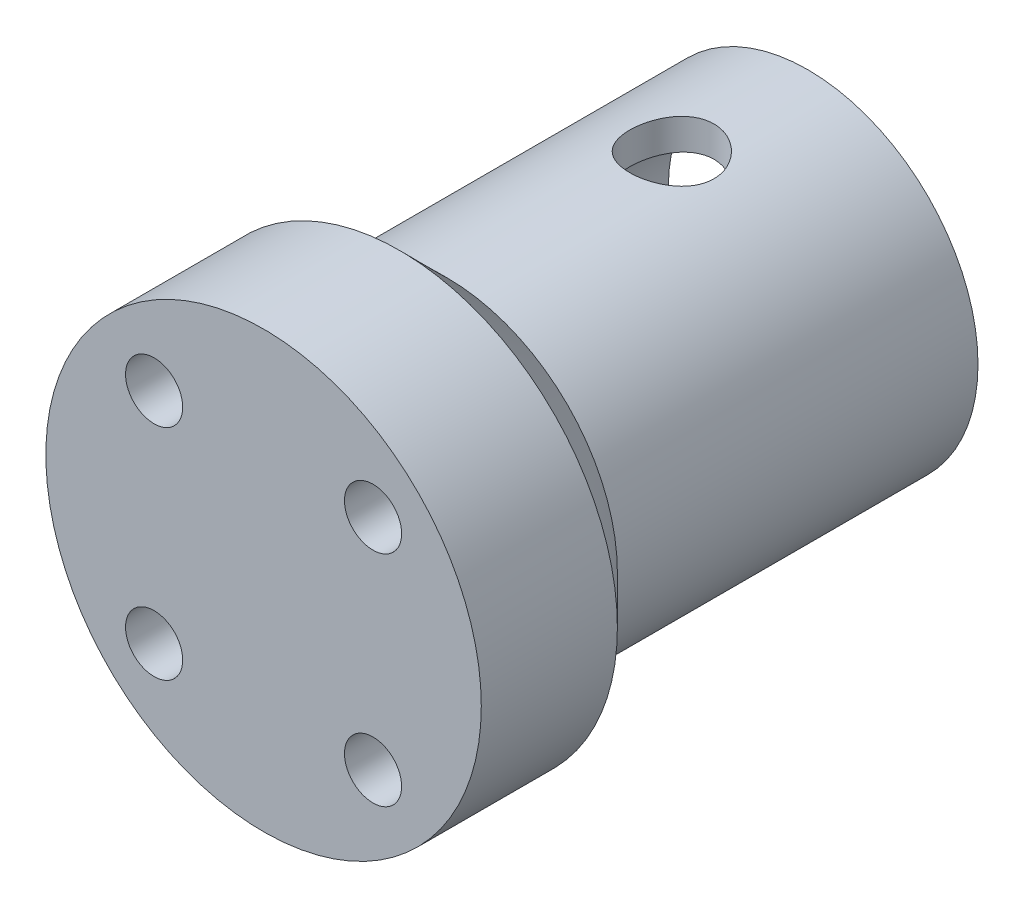
ISO-10303-21;
HEADER;
FILE_DESCRIPTION(('STEP AP214'),'2;1');
FILE_NAME('part.step','',(''),(''),'','','');
FILE_SCHEMA(('AUTOMOTIVE_DESIGN { 1 0 10303 214 1 1 1 1 }'));
ENDSEC;
DATA;
#1=APPLICATION_CONTEXT('core data for automotive mechanical design processes');
#2=APPLICATION_PROTOCOL_DEFINITION('international standard','automotive_design',2000,#1);
#3=PRODUCT_CONTEXT('',#1,'mechanical');
#4=PRODUCT('Part','Part','',(#3));
#5=PRODUCT_RELATED_PRODUCT_CATEGORY('part','',(#4));
#6=PRODUCT_DEFINITION_FORMATION('','',#4);
#7=PRODUCT_DEFINITION_CONTEXT('part definition',#1,'design');
#8=PRODUCT_DEFINITION('design','',#6,#7);
#9=PRODUCT_DEFINITION_SHAPE('','',#8);
#10=(LENGTH_UNIT() NAMED_UNIT(*) SI_UNIT(.MILLI.,.METRE.));
#11=(NAMED_UNIT(*) PLANE_ANGLE_UNIT() SI_UNIT($,.RADIAN.));
#12=(NAMED_UNIT(*) SI_UNIT($,.STERADIAN.) SOLID_ANGLE_UNIT());
#13=UNCERTAINTY_MEASURE_WITH_UNIT(LENGTH_MEASURE(1.E-05),#10,'distance_accuracy_value','');
#14=(GEOMETRIC_REPRESENTATION_CONTEXT(3) GLOBAL_UNCERTAINTY_ASSIGNED_CONTEXT((#13)) GLOBAL_UNIT_ASSIGNED_CONTEXT((#10,
#11,#12)) REPRESENTATION_CONTEXT('',''));
#15=CARTESIAN_POINT('',(0.,0.,0.));
#16=DIRECTION('',(0.,0.,1.));
#17=DIRECTION('',(1.,0.,0.));
#18=AXIS2_PLACEMENT_3D('',#15,#16,#17);
#19=CARTESIAN_POINT('',(0.,0.,10.));
#20=DIRECTION('',(0.,0.,-1.));
#21=DIRECTION('',(-1.,0.,0.));
#22=AXIS2_PLACEMENT_3D('',#19,#20,#21);
#23=CYLINDRICAL_SURFACE('',#22,16.);
#24=CARTESIAN_POINT('',(0.,0.,10.));
#25=DIRECTION('',(0.,0.,1.));
#26=DIRECTION('',(1.,0.,0.));
#27=AXIS2_PLACEMENT_3D('',#24,#25,#26);
#28=CIRCLE('',#27,16.);
#29=CARTESIAN_POINT('',(16.,0.,10.));
#30=VERTEX_POINT('',#29);
#31=EDGE_CURVE('E48',#30,#30,#28,.T.);
#32=ORIENTED_EDGE('',*,*,#31,.F.);
#33=EDGE_LOOP('',(#32));
#34=FACE_BOUND('',#33,.T.);
#35=CARTESIAN_POINT('',(0.,0.,0.));
#36=DIRECTION('',(0.,0.,1.));
#37=DIRECTION('',(1.,0.,0.));
#38=AXIS2_PLACEMENT_3D('',#35,#36,#37);
#39=CIRCLE('',#38,16.);
#40=CARTESIAN_POINT('',(16.,0.,0.));
#41=VERTEX_POINT('',#40);
#42=EDGE_CURVE('E52',#41,#41,#39,.T.);
#43=ORIENTED_EDGE('',*,*,#42,.T.);
#44=EDGE_LOOP('',(#43));
#45=FACE_BOUND('',#44,.T.);
#46=ADVANCED_FACE('F40',(#34,#45),#23,.T.);
#47=CARTESIAN_POINT('',(0.,0.,10.));
#48=DIRECTION('',(0.,0.,1.));
#49=DIRECTION('',(1.,0.,0.));
#50=AXIS2_PLACEMENT_3D('',#47,#48,#49);
#51=PLANE('',#50);
#52=CARTESIAN_POINT('',(-8.04416807232347,-8.04416807232347,10.));
#53=DIRECTION('',(0.,0.,1.));
#54=DIRECTION('',(1.,0.,0.));
#55=AXIS2_PLACEMENT_3D('',#52,#53,#54);
#56=CIRCLE('',#55,2.1);
#57=CARTESIAN_POINT('',(-5.94416807232347,-8.04416807232347,10.));
#58=VERTEX_POINT('',#57);
#59=EDGE_CURVE('E275',#58,#58,#56,.T.);
#60=ORIENTED_EDGE('',*,*,#59,.F.);
#61=EDGE_LOOP('',(#60));
#62=FACE_BOUND('',#61,.T.);
#63=CARTESIAN_POINT('',(8.04416807232347,-8.04416807232347,10.));
#64=DIRECTION('',(0.,0.,1.));
#65=DIRECTION('',(1.,0.,0.));
#66=AXIS2_PLACEMENT_3D('',#63,#64,#65);
#67=CIRCLE('',#66,2.1);
#68=CARTESIAN_POINT('',(10.1441680723235,-8.04416807232347,10.));
#69=VERTEX_POINT('',#68);
#70=EDGE_CURVE('E281',#69,#69,#67,.T.);
#71=ORIENTED_EDGE('',*,*,#70,.F.);
#72=EDGE_LOOP('',(#71));
#73=FACE_BOUND('',#72,.T.);
#74=CARTESIAN_POINT('',(8.04416807232347,8.04416807232347,10.));
#75=DIRECTION('',(0.,0.,1.));
#76=DIRECTION('',(1.,0.,0.));
#77=AXIS2_PLACEMENT_3D('',#74,#75,#76);
#78=CIRCLE('',#77,2.1);
#79=CARTESIAN_POINT('',(10.1441680723235,8.04416807232347,10.));
#80=VERTEX_POINT('',#79);
#81=EDGE_CURVE('E287',#80,#80,#78,.T.);
#82=ORIENTED_EDGE('',*,*,#81,.F.);
#83=EDGE_LOOP('',(#82));
#84=FACE_BOUND('',#83,.T.);
#85=CARTESIAN_POINT('',(-8.04416807232347,8.04416807232347,10.));
#86=DIRECTION('',(0.,0.,1.));
#87=DIRECTION('',(1.,0.,0.));
#88=AXIS2_PLACEMENT_3D('',#85,#86,#87);
#89=CIRCLE('',#88,2.1);
#90=CARTESIAN_POINT('',(-5.94416807232347,8.04416807232347,10.));
#91=VERTEX_POINT('',#90);
#92=EDGE_CURVE('E269',#91,#91,#89,.T.);
#93=ORIENTED_EDGE('',*,*,#92,.F.);
#94=EDGE_LOOP('',(#93));
#95=FACE_BOUND('',#94,.T.);
#96=ORIENTED_EDGE('',*,*,#31,.T.);
#97=EDGE_LOOP('',(#96));
#98=FACE_BOUND('',#97,.T.);
#99=ADVANCED_FACE('F106',(#62,#73,#84,#95,#98),#51,.T.);
#100=CARTESIAN_POINT('',(0.,0.,-30.));
#101=DIRECTION('',(0.,0.,-1.));
#102=DIRECTION('',(-1.,0.,0.));
#103=AXIS2_PLACEMENT_3D('',#100,#101,#102);
#104=PLANE('',#103);
#105=CARTESIAN_POINT('',(0.,0.,-30.));
#106=DIRECTION('',(0.,0.,-1.));
#107=DIRECTION('',(-1.,0.,0.));
#108=AXIS2_PLACEMENT_3D('',#105,#106,#107);
#109=CIRCLE('',#108,12.5);
#110=CARTESIAN_POINT('',(-12.5,0.,-30.));
#111=VERTEX_POINT('',#110);
#112=EDGE_CURVE('E57',#111,#111,#109,.T.);
#113=ORIENTED_EDGE('',*,*,#112,.T.);
#114=EDGE_LOOP('',(#113));
#115=FACE_BOUND('',#114,.T.);
#116=CARTESIAN_POINT('',(0.,0.,-30.));
#117=DIRECTION('',(0.,0.,-1.));
#118=DIRECTION('',(-1.,0.,0.));
#119=AXIS2_PLACEMENT_3D('',#116,#117,#118);
#120=CIRCLE('',#119,10.25);
#121=CARTESIAN_POINT('',(-10.25,0.,-30.));
#122=VERTEX_POINT('',#121);
#123=EDGE_CURVE('E262',#122,#122,#120,.T.);
#124=ORIENTED_EDGE('',*,*,#123,.F.);
#125=EDGE_LOOP('',(#124));
#126=FACE_BOUND('',#125,.T.);
#127=ADVANCED_FACE('F105',(#115,#126),#104,.T.);
#128=CARTESIAN_POINT('',(0.,0.,-30.));
#129=DIRECTION('',(0.,0.,1.));
#130=DIRECTION('',(1.,0.,0.));
#131=AXIS2_PLACEMENT_3D('',#128,#129,#130);
#132=CYLINDRICAL_SURFACE('',#131,12.5);
#133=CARTESIAN_POINT('',(0.,0.,-3.50000000000004));
#134=DIRECTION('',(0.,0.,1.));
#135=DIRECTION('',(1.,0.,0.));
#136=AXIS2_PLACEMENT_3D('',#133,#134,#135);
#137=CIRCLE('',#136,12.5);
#138=CARTESIAN_POINT('',(12.5,0.,-3.50000000000004));
#139=VERTEX_POINT('',#138);
#140=EDGE_CURVE('E10',#139,#139,#137,.F.);
#141=ORIENTED_EDGE('',*,*,#140,.T.);
#142=EDGE_LOOP('',(#141));
#143=FACE_BOUND('',#142,.T.);
#144=CARTESIAN_POINT('',(0.,-12.5,-16.9));
#145=CARTESIAN_POINT('',(0.171321664400404,-12.4999970744373,-16.9000048872047));
#146=CARTESIAN_POINT('',(0.342698199935586,-12.4964427275084,-16.9142499416371));
#147=CARTESIAN_POINT('',(0.680542561870351,-12.4826080632765,-16.9707702237728));
#148=CARTESIAN_POINT('',(0.847007499357506,-12.4723238668892,-17.0130616175709));
#149=CARTESIAN_POINT('',(1.17010085455231,-12.4461687418038,-17.1242364514696));
#150=CARTESIAN_POINT('',(1.32674072515856,-12.4303044658781,-17.1930882347288));
#151=CARTESIAN_POINT('',(1.62624649710241,-12.394680256543,-17.3553187443412));
#152=CARTESIAN_POINT('',(1.7691119875041,-12.3749202069631,-17.4486982021277));
#153=CARTESIAN_POINT('',(2.03991290631521,-12.3332026747787,-17.659335026922));
#154=CARTESIAN_POINT('',(2.1675290099086,-12.3112117240301,-17.776996320504));
#155=CARTESIAN_POINT('',(2.40143368174175,-12.2677341430607,-18.0319918776379));
#156=CARTESIAN_POINT('',(2.50771987891311,-12.2462475691416,-18.1693283254081));
#157=CARTESIAN_POINT('',(2.69744315982981,-12.205874642359,-18.4622471331786));
#158=CARTESIAN_POINT('',(2.78052420451507,-12.1870308061921,-18.6180664914836));
#159=CARTESIAN_POINT('',(2.91918958015416,-12.1545645156394,-18.9420026126077));
#160=CARTESIAN_POINT('',(2.97477823022032,-12.1409412411682,-19.1101174390165));
#161=CARTESIAN_POINT('',(3.05579378999697,-12.1208023299988,-19.4503641344839));
#162=CARTESIAN_POINT('',(3.08179427576544,-12.114151733632,-19.6223512574906));
#163=CARTESIAN_POINT('',(3.10468184536668,-12.1083071258447,-19.968364970787));
#164=CARTESIAN_POINT('',(3.10157358546517,-12.1091119218515,-20.1423912304464));
#165=CARTESIAN_POINT('',(3.06678979281697,-12.1179657886451,-20.4831563682255));
#166=CARTESIAN_POINT('',(3.03579655534501,-12.1258418291493,-20.6499700885263));
#167=CARTESIAN_POINT('',(2.9472104978581,-12.1476751524837,-20.9759532190732));
#168=CARTESIAN_POINT('',(2.88961580981169,-12.1616328623825,-21.135122091609));
#169=CARTESIAN_POINT('',(2.74887729836579,-12.1942164438807,-21.4431328166276));
#170=CARTESIAN_POINT('',(2.66548486483281,-12.212887399518,-21.5918561028082));
#171=CARTESIAN_POINT('',(2.47569199889464,-12.2527681293459,-21.8734433733486));
#172=CARTESIAN_POINT('',(2.36928759953095,-12.2739783409889,-22.0063046171656));
#173=CARTESIAN_POINT('',(2.13295176560006,-12.3172772174208,-22.2563076121935));
#174=CARTESIAN_POINT('',(2.00244425055895,-12.3393738369417,-22.3729040724109));
#175=CARTESIAN_POINT('',(1.72346462078662,-12.3814190930218,-22.5826587697337));
#176=CARTESIAN_POINT('',(1.57499197458076,-12.4013676660008,-22.6758163131785));
#177=CARTESIAN_POINT('',(1.26352628359607,-12.436965896406,-22.8362444980427));
#178=CARTESIAN_POINT('',(1.10048644386271,-12.4526009882721,-22.903427729828));
#179=CARTESIAN_POINT('',(0.764953276659557,-12.4777045587792,-23.00928185667));
#180=CARTESIAN_POINT('',(0.592461734432032,-12.4871741976308,-23.0479581163302));
#181=CARTESIAN_POINT('',(0.247584727541146,-12.4987086405589,-23.0948703438841));
#182=CARTESIAN_POINT('',(0.075306186399365,-12.5009540793697,-23.1038490373888));
#183=CARTESIAN_POINT('',(-0.268291654844462,-12.4983010417357,-23.0931467355537));
#184=CARTESIAN_POINT('',(-0.439611038481995,-12.4934031974481,-23.0734682762784));
#185=CARTESIAN_POINT('',(-0.773854623249372,-12.4771295628517,-23.0066227647375));
#186=CARTESIAN_POINT('',(-0.936864706674164,-12.4658490657398,-22.9598598467889));
#187=CARTESIAN_POINT('',(-1.25271883450351,-12.4380808234419,-22.8406335734146));
#188=CARTESIAN_POINT('',(-1.40556185997589,-12.4215925572876,-22.768167646654));
#189=CARTESIAN_POINT('',(-1.69970617719639,-12.3848041549636,-22.5981457233726));
#190=CARTESIAN_POINT('',(-1.84075831013918,-12.3644422897096,-22.5001723490318));
#191=CARTESIAN_POINT('',(-2.10468362392406,-12.3222644157331,-22.2824511933504));
#192=CARTESIAN_POINT('',(-2.22755371369889,-12.3004481606672,-22.1626997172845));
#193=CARTESIAN_POINT('',(-2.45467959232091,-12.2571718419377,-21.9013755745171));
#194=CARTESIAN_POINT('',(-2.55841478130358,-12.2357330698001,-21.7593461573546));
#195=CARTESIAN_POINT('',(-2.74057686891171,-12.1962272998913,-21.4594560253622));
#196=CARTESIAN_POINT('',(-2.8190048945673,-12.1781601519832,-21.301596015943));
#197=CARTESIAN_POINT('',(-2.9477445690088,-12.1476409741498,-20.9753760576118));
#198=CARTESIAN_POINT('',(-2.99822281807697,-12.1351557598304,-20.8070851222937));
#199=CARTESIAN_POINT('',(-3.07007327072758,-12.1171798507323,-20.4640492469487));
#200=CARTESIAN_POINT('',(-3.09145171890727,-12.1116876553209,-20.289305699873));
#201=CARTESIAN_POINT('',(-3.10417336861403,-12.108432703985,-19.9436190437054));
#202=CARTESIAN_POINT('',(-3.09634814893758,-12.1104559373427,-19.7727080589388));
#203=CARTESIAN_POINT('',(-3.05278480991634,-12.1215098074069,-19.4347240547861));
#204=CARTESIAN_POINT('',(-3.01704723431604,-12.1305403076089,-19.2676509607016));
#205=CARTESIAN_POINT('',(-2.91912445289163,-12.1544728918257,-18.9429730131117));
#206=CARTESIAN_POINT('',(-2.85709286485989,-12.1693408350488,-18.7853191392955));
#207=CARTESIAN_POINT('',(-2.70846488738504,-12.2032783702695,-18.4825448997591));
#208=CARTESIAN_POINT('',(-2.62186514494892,-12.2223485356952,-18.33742624834));
#209=CARTESIAN_POINT('',(-2.42394187068031,-12.2631540460336,-18.0598178315526));
#210=CARTESIAN_POINT('',(-2.31204024829818,-12.2849452810484,-17.927748366432));
#211=CARTESIAN_POINT('',(-2.06781935033019,-12.3284012992647,-17.6839911697143));
#212=CARTESIAN_POINT('',(-1.93549524471299,-12.3500660512909,-17.5723082733287));
#213=CARTESIAN_POINT('',(-1.65135189387908,-12.3912866419367,-17.3705643842122));
#214=CARTESIAN_POINT('',(-1.49922839808283,-12.4107982406086,-17.2809221982985));
#215=CARTESIAN_POINT('',(-1.18160190399274,-12.4450491405072,-17.1286262145889));
#216=CARTESIAN_POINT('',(-1.01610871029469,-12.4597918999384,-17.0659528489536));
#217=CARTESIAN_POINT('',(-0.7090642255727,-12.4806334141632,-16.9788052313771));
#218=CARTESIAN_POINT('',(-0.56899042198698,-12.4878463398253,-16.9493166178645));
#219=CARTESIAN_POINT('',(-0.285957014303812,-12.4975306811855,-16.9099126746704));
#220=CARTESIAN_POINT('',(-0.142997620950288,-12.5000024418891,-16.8999959207807));
#221=CARTESIAN_POINT('',(0.,-12.5,-16.9));
#222=B_SPLINE_CURVE_WITH_KNOTS('',3,(#144,#145,#146,#147,#148,#149,#150,#151,#152,#153,#154,
#155,#156,#157,#158,#159,#160,#161,#162,#163,#164,#165,#166,#167,#168,#169,#170,#171,#172,#173,
#174,#175,#176,#177,#178,#179,#180,#181,#182,#183,#184,#185,#186,#187,#188,#189,#190,#191,#192,
#193,#194,#195,#196,#197,#198,#199,#200,#201,#202,#203,#204,#205,#206,#207,#208,#209,#210,#211,
#212,#213,#214,#215,#216,#217,#218,#219,#220,#221),.UNSPECIFIED.,.T.,.F.,(4,2,2,2,2,2,2,2,2,2,2,
2,2,2,2,2,2,2,2,2,2,2,2,2,2,2,2,2,2,2,2,2,2,2,2,2,2,2,4),(0.,0.513441001546216,1.02717821139763,
1.54030498976174,2.05344707168326,2.57593534685751,3.09848167057754,3.62865286244701,
4.15874073684168,4.67836762581721,5.19791139614611,5.70507856217838,6.21228134838471,
6.72453284450536,7.23687271649583,7.7635798231206,8.29030251548985,8.81878263668009,
9.34716328007545,9.8622251847555,10.3772415109032,10.8847641786345,11.3923376333759,
11.9088047483598,12.4253595655347,12.9543766368929,13.4833701457333,14.0091755712053,
14.5348681450108,15.0457072700366,15.5565364439487,16.0644214587247,16.5723758216,
17.093381790987,17.6145111705551,18.1448871531183,18.6748776577964,19.1034643474141,
19.5320198484151),.UNSPECIFIED.);
#223=CARTESIAN_POINT('',(0.,-12.5,-16.9));
#224=VERTEX_POINT('',#223);
#225=EDGE_CURVE('E96',#224,#224,#222,.T.);
#226=ORIENTED_EDGE('',*,*,#225,.T.);
#227=EDGE_LOOP('',(#226));
#228=FACE_BOUND('',#227,.T.);
#229=CARTESIAN_POINT('',(0.,12.5,-16.9));
#230=CARTESIAN_POINT('',(-0.171321664400404,12.4999970744373,-16.9000048872047));
#231=CARTESIAN_POINT('',(-0.342698199935586,12.4964427275084,-16.9142499416371));
#232=CARTESIAN_POINT('',(-0.680542561870351,12.4826080632765,-16.9707702237728));
#233=CARTESIAN_POINT('',(-0.847007499357506,12.4723238668892,-17.0130616175709));
#234=CARTESIAN_POINT('',(-1.17010085455231,12.4461687418038,-17.1242364514696));
#235=CARTESIAN_POINT('',(-1.32674072515856,12.4303044658781,-17.1930882347288));
#236=CARTESIAN_POINT('',(-1.62624649710241,12.394680256543,-17.3553187443412));
#237=CARTESIAN_POINT('',(-1.7691119875041,12.3749202069631,-17.4486982021277));
#238=CARTESIAN_POINT('',(-2.03991290631521,12.3332026747787,-17.659335026922));
#239=CARTESIAN_POINT('',(-2.1675290099086,12.3112117240301,-17.776996320504));
#240=CARTESIAN_POINT('',(-2.40143368174175,12.2677341430607,-18.0319918776379));
#241=CARTESIAN_POINT('',(-2.50771987891311,12.2462475691416,-18.1693283254081));
#242=CARTESIAN_POINT('',(-2.69744315982981,12.205874642359,-18.4622471331786));
#243=CARTESIAN_POINT('',(-2.78052420451507,12.1870308061921,-18.6180664914836));
#244=CARTESIAN_POINT('',(-2.91918958015416,12.1545645156394,-18.9420026126077));
#245=CARTESIAN_POINT('',(-2.97477823022032,12.1409412411682,-19.1101174390165));
#246=CARTESIAN_POINT('',(-3.05579378999697,12.1208023299988,-19.4503641344839));
#247=CARTESIAN_POINT('',(-3.08179427576544,12.114151733632,-19.6223512574906));
#248=CARTESIAN_POINT('',(-3.10468184536668,12.1083071258447,-19.968364970787));
#249=CARTESIAN_POINT('',(-3.10157358546517,12.1091119218515,-20.1423912304464));
#250=CARTESIAN_POINT('',(-3.06678979281697,12.1179657886451,-20.4831563682255));
#251=CARTESIAN_POINT('',(-3.03579655534501,12.1258418291493,-20.6499700885263));
#252=CARTESIAN_POINT('',(-2.9472104978581,12.1476751524837,-20.9759532190732));
#253=CARTESIAN_POINT('',(-2.88961580981169,12.1616328623825,-21.135122091609));
#254=CARTESIAN_POINT('',(-2.74887729836579,12.1942164438807,-21.4431328166276));
#255=CARTESIAN_POINT('',(-2.66548486483281,12.212887399518,-21.5918561028082));
#256=CARTESIAN_POINT('',(-2.47569199889464,12.2527681293459,-21.8734433733486));
#257=CARTESIAN_POINT('',(-2.36928759953095,12.2739783409889,-22.0063046171656));
#258=CARTESIAN_POINT('',(-2.13295176560006,12.3172772174208,-22.2563076121935));
#259=CARTESIAN_POINT('',(-2.00244425055895,12.3393738369417,-22.3729040724109));
#260=CARTESIAN_POINT('',(-1.72346462078662,12.3814190930218,-22.5826587697337));
#261=CARTESIAN_POINT('',(-1.57499197458076,12.4013676660008,-22.6758163131785));
#262=CARTESIAN_POINT('',(-1.26352628359607,12.436965896406,-22.8362444980427));
#263=CARTESIAN_POINT('',(-1.10048644386271,12.4526009882721,-22.903427729828));
#264=CARTESIAN_POINT('',(-0.764953276659557,12.4777045587792,-23.00928185667));
#265=CARTESIAN_POINT('',(-0.592461734432032,12.4871741976308,-23.0479581163302));
#266=CARTESIAN_POINT('',(-0.247584727541146,12.4987086405589,-23.0948703438841));
#267=CARTESIAN_POINT('',(-0.075306186399365,12.5009540793697,-23.1038490373888));
#268=CARTESIAN_POINT('',(0.268291654844462,12.4983010417357,-23.0931467355537));
#269=CARTESIAN_POINT('',(0.439611038481995,12.4934031974481,-23.0734682762784));
#270=CARTESIAN_POINT('',(0.773854623249372,12.4771295628517,-23.0066227647375));
#271=CARTESIAN_POINT('',(0.936864706674164,12.4658490657398,-22.9598598467889));
#272=CARTESIAN_POINT('',(1.25271883450351,12.4380808234419,-22.8406335734146));
#273=CARTESIAN_POINT('',(1.40556185997589,12.4215925572876,-22.768167646654));
#274=CARTESIAN_POINT('',(1.69970617719639,12.3848041549636,-22.5981457233726));
#275=CARTESIAN_POINT('',(1.84075831013918,12.3644422897096,-22.5001723490318));
#276=CARTESIAN_POINT('',(2.10468362392406,12.3222644157331,-22.2824511933504));
#277=CARTESIAN_POINT('',(2.22755371369889,12.3004481606672,-22.1626997172845));
#278=CARTESIAN_POINT('',(2.45467959232091,12.2571718419377,-21.9013755745171));
#279=CARTESIAN_POINT('',(2.55841478130358,12.2357330698001,-21.7593461573546));
#280=CARTESIAN_POINT('',(2.74057686891171,12.1962272998913,-21.4594560253622));
#281=CARTESIAN_POINT('',(2.8190048945673,12.1781601519832,-21.301596015943));
#282=CARTESIAN_POINT('',(2.9477445690088,12.1476409741498,-20.9753760576118));
#283=CARTESIAN_POINT('',(2.99822281807697,12.1351557598304,-20.8070851222937));
#284=CARTESIAN_POINT('',(3.07007327072758,12.1171798507323,-20.4640492469487));
#285=CARTESIAN_POINT('',(3.09145171890727,12.1116876553209,-20.289305699873));
#286=CARTESIAN_POINT('',(3.10417336861403,12.108432703985,-19.9436190437054));
#287=CARTESIAN_POINT('',(3.09634814893758,12.1104559373427,-19.7727080589388));
#288=CARTESIAN_POINT('',(3.05278480991634,12.1215098074069,-19.4347240547861));
#289=CARTESIAN_POINT('',(3.01704723431604,12.1305403076089,-19.2676509607016));
#290=CARTESIAN_POINT('',(2.91912445289163,12.1544728918257,-18.9429730131117));
#291=CARTESIAN_POINT('',(2.85709286485989,12.1693408350488,-18.7853191392955));
#292=CARTESIAN_POINT('',(2.70846488738504,12.2032783702695,-18.4825448997591));
#293=CARTESIAN_POINT('',(2.62186514494892,12.2223485356952,-18.33742624834));
#294=CARTESIAN_POINT('',(2.42394187068031,12.2631540460336,-18.0598178315526));
#295=CARTESIAN_POINT('',(2.31204024829818,12.2849452810484,-17.927748366432));
#296=CARTESIAN_POINT('',(2.06781935033019,12.3284012992647,-17.6839911697143));
#297=CARTESIAN_POINT('',(1.93549524471299,12.3500660512909,-17.5723082733287));
#298=CARTESIAN_POINT('',(1.65135189387908,12.3912866419367,-17.3705643842122));
#299=CARTESIAN_POINT('',(1.49922839808283,12.4107982406086,-17.2809221982985));
#300=CARTESIAN_POINT('',(1.18160190399274,12.4450491405072,-17.1286262145889));
#301=CARTESIAN_POINT('',(1.01610871029469,12.4597918999384,-17.0659528489536));
#302=CARTESIAN_POINT('',(0.7090642255727,12.4806334141632,-16.9788052313771));
#303=CARTESIAN_POINT('',(0.56899042198698,12.4878463398253,-16.9493166178645));
#304=CARTESIAN_POINT('',(0.285957014303812,12.4975306811855,-16.9099126746704));
#305=CARTESIAN_POINT('',(0.142997620950288,12.5000024418891,-16.8999959207807));
#306=CARTESIAN_POINT('',(0.,12.5,-16.9));
#307=B_SPLINE_CURVE_WITH_KNOTS('',3,(#229,#230,#231,#232,#233,#234,#235,#236,#237,#238,#239,
#240,#241,#242,#243,#244,#245,#246,#247,#248,#249,#250,#251,#252,#253,#254,#255,#256,#257,#258,
#259,#260,#261,#262,#263,#264,#265,#266,#267,#268,#269,#270,#271,#272,#273,#274,#275,#276,#277,
#278,#279,#280,#281,#282,#283,#284,#285,#286,#287,#288,#289,#290,#291,#292,#293,#294,#295,#296,
#297,#298,#299,#300,#301,#302,#303,#304,#305,#306),.UNSPECIFIED.,.T.,.F.,(4,2,2,2,2,2,2,2,2,2,2,
2,2,2,2,2,2,2,2,2,2,2,2,2,2,2,2,2,2,2,2,2,2,2,2,2,2,2,4),(0.,0.513441001546216,1.02717821139763,
1.54030498976174,2.05344707168326,2.57593534685751,3.09848167057754,3.62865286244701,
4.15874073684168,4.67836762581721,5.19791139614611,5.70507856217838,6.21228134838471,
6.72453284450536,7.23687271649583,7.7635798231206,8.29030251548985,8.81878263668009,
9.34716328007545,9.8622251847555,10.3772415109032,10.8847641786345,11.3923376333759,
11.9088047483598,12.4253595655347,12.9543766368929,13.4833701457333,14.0091755712053,
14.5348681450108,15.0457072700366,15.5565364439487,16.0644214587247,16.5723758216,
17.093381790987,17.6145111705551,18.1448871531183,18.6748776577964,19.1034643474141,
19.5320198484151),.UNSPECIFIED.);
#308=CARTESIAN_POINT('',(0.,12.5,-16.9));
#309=VERTEX_POINT('',#308);
#310=EDGE_CURVE('E90',#309,#309,#307,.T.);
#311=ORIENTED_EDGE('',*,*,#310,.T.);
#312=EDGE_LOOP('',(#311));
#313=FACE_BOUND('',#312,.T.);
#314=ORIENTED_EDGE('',*,*,#112,.F.);
#315=EDGE_LOOP('',(#314));
#316=FACE_BOUND('',#315,.T.);
#317=ADVANCED_FACE('F101',(#143,#228,#313,#316),#132,.T.);
#318=CARTESIAN_POINT('',(0.,0.,-30.));
#319=DIRECTION('',(0.,0.,1.));
#320=DIRECTION('',(1.,0.,0.));
#321=AXIS2_PLACEMENT_3D('',#318,#319,#320);
#322=CYLINDRICAL_SURFACE('',#321,10.25);
#323=CARTESIAN_POINT('',(0.,-10.25,-16.9));
#324=CARTESIAN_POINT('',(0.169998907474381,-10.2499986485747,-16.9000018851297));
#325=CARTESIAN_POINT('',(0.340016902409208,-10.2457304553936,-16.9140299977492));
#326=CARTESIAN_POINT('',(0.675097778234493,-10.2291210021059,-16.9696359536023));
#327=CARTESIAN_POINT('',(0.840159236187139,-10.2167774464413,-17.0112216305817));
#328=CARTESIAN_POINT('',(1.16044579236968,-10.1853689972876,-17.1204242931071));
#329=CARTESIAN_POINT('',(1.31568514159846,-10.1663141179918,-17.1880025080594));
#330=CARTESIAN_POINT('',(1.61262913710012,-10.1234610285142,-17.347111812526));
#331=CARTESIAN_POINT('',(1.75433191395728,-10.0996621645796,-17.4386462039061));
#332=CARTESIAN_POINT('',(2.02430836641813,-10.049081997796,-17.6458785375876));
#333=CARTESIAN_POINT('',(2.15213211850093,-10.0222388241387,-17.7621474845254));
#334=CARTESIAN_POINT('',(2.38679639386606,-9.96896243970693,-18.0143317138155));
#335=CARTESIAN_POINT('',(2.49363331591044,-9.94252930000771,-18.1502503610265));
#336=CARTESIAN_POINT('',(2.68567266447012,-9.8924094694416,-18.4416996586723));
#337=CARTESIAN_POINT('',(2.77032344517852,-9.86879956232508,-18.5976082425075));
#338=CARTESIAN_POINT('',(2.91202047957526,-9.82792523017693,-18.9222773386841));
#339=CARTESIAN_POINT('',(2.96907348467467,-9.81065925343993,-19.0910346960484));
#340=CARTESIAN_POINT('',(3.05232843443081,-9.78507291996387,-19.4315538586602));
#341=CARTESIAN_POINT('',(3.07936084480713,-9.77651234357982,-19.6030940822371));
#342=CARTESIAN_POINT('',(3.10440072658286,-9.76859171908716,-19.9484721591263));
#343=CARTESIAN_POINT('',(3.1024153601616,-9.76922940066031,-20.1223094348962));
#344=CARTESIAN_POINT('',(3.07012781045482,-9.77942050600959,-20.4605714157908));
#345=CARTESIAN_POINT('',(3.04086897499942,-9.78864540764713,-20.6251072520089));
#346=CARTESIAN_POINT('',(2.95655188758493,-9.81443963165813,-20.9468160917569));
#347=CARTESIAN_POINT('',(2.90149105193747,-9.83100968953127,-21.1039883561999));
#348=CARTESIAN_POINT('',(2.76637055981477,-9.86988736939812,-21.4090477012581));
#349=CARTESIAN_POINT('',(2.68597459825036,-9.89227142055988,-21.5567756647813));
#350=CARTESIAN_POINT('',(2.50269971043939,-9.94021856210211,-21.8369919945316));
#351=CARTESIAN_POINT('',(2.39981525926767,-9.96578243302781,-21.9694766035731));
#352=CARTESIAN_POINT('',(2.1693140840697,-10.0185383887435,-22.2213594546257));
#353=CARTESIAN_POINT('',(2.04083238870279,-10.0457535086097,-22.3399627056585));
#354=CARTESIAN_POINT('',(1.76546424052702,-10.0977840647359,-22.5541261748584));
#355=CARTESIAN_POINT('',(1.61857659218054,-10.1225993449314,-22.649684895014));
#356=CARTESIAN_POINT('',(1.30910451851496,-10.1672671900772,-22.8155401334522));
#357=CARTESIAN_POINT('',(1.14641875204233,-10.1870843204692,-22.8856577410452));
#358=CARTESIAN_POINT('',(0.810824762503999,-10.2192675793286,-22.9973005145229));
#359=CARTESIAN_POINT('',(0.637919454242654,-10.231635821204,-23.0388337908676));
#360=CARTESIAN_POINT('',(0.293550946037442,-10.2471923493182,-23.0907994935117));
#361=CARTESIAN_POINT('',(0.122264412949357,-10.2506984482696,-23.1023091295435));
#362=CARTESIAN_POINT('',(-0.21980513843335,-10.2490694970045,-23.0969235495188));
#363=CARTESIAN_POINT('',(-0.390588221991792,-10.2439356210482,-23.0800321934454));
#364=CARTESIAN_POINT('',(-0.722720056540794,-10.225811769111,-23.0191939475393));
#365=CARTESIAN_POINT('',(-0.884195478217268,-10.2130053291338,-22.9758787172299));
#366=CARTESIAN_POINT('',(-1.19754984242918,-10.1810216500835,-22.8641843322938));
#367=CARTESIAN_POINT('',(-1.34942762216979,-10.1618436408223,-22.7958021474993));
#368=CARTESIAN_POINT('',(-1.64322151611196,-10.1185425447494,-22.6341210847893));
#369=CARTESIAN_POINT('',(-1.78482166956641,-10.0943143164365,-22.5402769869842));
#370=CARTESIAN_POINT('',(-2.05063017092418,-10.0436922680632,-22.3309968901902));
#371=CARTESIAN_POINT('',(-2.17483407570261,-10.0172978974748,-22.2155553925937));
#372=CARTESIAN_POINT('',(-2.40708231928704,-9.96409500793852,-21.9612951657947));
#373=CARTESIAN_POINT('',(-2.51435997261893,-9.93730722333416,-21.8217702524755));
#374=CARTESIAN_POINT('',(-2.70403577222231,-9.88738308584541,-21.5261165213744));
#375=CARTESIAN_POINT('',(-2.78643452621176,-9.8642466437761,-21.3699881092928));
#376=CARTESIAN_POINT('',(-2.92345868136852,-9.82450952222467,-21.0460251995035));
#377=CARTESIAN_POINT('',(-2.97820967107195,-9.80787936735071,-20.8782476466));
#378=CARTESIAN_POINT('',(-3.05851197702548,-9.78313877155528,-20.5352557172971));
#379=CARTESIAN_POINT('',(-3.08407350854966,-9.77502535015979,-20.3600439648813));
#380=CARTESIAN_POINT('',(-3.10456918126415,-9.76853375942863,-20.015131524349));
#381=CARTESIAN_POINT('',(-3.10075463378345,-9.76975782626448,-19.8455117172442));
#382=CARTESIAN_POINT('',(-3.06559982106048,-9.78084504776096,-19.5094512780734));
#383=CARTESIAN_POINT('',(-3.03426069192308,-9.7907078458492,-19.343010515079));
#384=CARTESIAN_POINT('',(-2.94575994750692,-9.81769224911057,-19.0201151824064));
#385=CARTESIAN_POINT('',(-2.8889347893318,-9.8347191014392,-18.8635598883775));
#386=CARTESIAN_POINT('',(-2.75133750011978,-9.87409437153586,-18.5620802871373));
#387=CARTESIAN_POINT('',(-2.67056072837486,-9.89644382041005,-18.417158240829));
#388=CARTESIAN_POINT('',(-2.48385879186797,-9.94497673675891,-18.1372653760141));
#389=CARTESIAN_POINT('',(-2.37711465707818,-9.9712713599242,-18.0028601411132));
#390=CARTESIAN_POINT('',(-2.14297579920764,-10.024197683213,-17.7534642973185));
#391=CARTESIAN_POINT('',(-2.01557568732565,-10.0508294696207,-17.6384787707292));
#392=CARTESIAN_POINT('',(-1.73915719573569,-10.1023835826429,-17.4277593101342));
#393=CARTESIAN_POINT('',(-1.5896065996068,-10.1272310516515,-17.33270328794));
#394=CARTESIAN_POINT('',(-1.27589521850188,-10.1715102739111,-17.1692152870067));
#395=CARTESIAN_POINT('',(-1.11174110216667,-10.1909444825276,-17.1007712319236));
#396=CARTESIAN_POINT('',(-0.79091931784938,-10.2205763717009,-16.9983632809695));
#397=CARTESIAN_POINT('',(-0.635216699210934,-10.2315181701382,-16.9615782068652));
#398=CARTESIAN_POINT('',(-0.319681198044391,-10.2462299973766,-16.9123977963468));
#399=CARTESIAN_POINT('',(-0.159849037146971,-10.2500012707377,-16.8999982274229));
#400=CARTESIAN_POINT('',(0.,-10.25,-16.9));
#401=B_SPLINE_CURVE_WITH_KNOTS('',3,(#323,#324,#325,#326,#327,#328,#329,#330,#331,#332,#333,
#334,#335,#336,#337,#338,#339,#340,#341,#342,#343,#344,#345,#346,#347,#348,#349,#350,#351,#352,
#353,#354,#355,#356,#357,#358,#359,#360,#361,#362,#363,#364,#365,#366,#367,#368,#369,#370,#371,
#372,#373,#374,#375,#376,#377,#378,#379,#380,#381,#382,#383,#384,#385,#386,#387,#388,#389,#390,
#391,#392,#393,#394,#395,#396,#397,#398,#399,#400),.UNSPECIFIED.,.T.,.F.,(4,2,2,2,2,2,2,2,2,2,2,
2,2,2,2,2,2,2,2,2,2,2,2,2,2,2,2,2,2,2,2,2,2,2,2,2,2,2,4),(0.,0.509409485521135,1.01896384223484,
1.52776107443126,2.03662847081834,2.55884796759667,3.0811569965731,3.61543063349555,
4.14957350163662,4.66854067101342,5.18737975086855,5.68715106709538,6.18697243871876,
6.69372982256834,7.20061184572809,7.72902636200459,8.25747521865004,8.78957140512189,
9.32151655339233,9.83409570169454,10.3466051909193,10.8473187360615,11.348092828916,
11.8605761031648,12.3731900315063,12.9047453198356,13.4362876227902,13.9653931993631,
14.4943135509658,15.0008325176668,15.5073305782694,16.0073303466151,16.5074270550196,
17.0260029009205,17.5447142529752,18.0789249681165,18.6128929780522,19.0919710731745,
19.5709660089882),.UNSPECIFIED.);
#402=CARTESIAN_POINT('',(0.,-10.25,-16.9));
#403=VERTEX_POINT('',#402);
#404=EDGE_CURVE('E69',#403,#403,#401,.T.);
#405=ORIENTED_EDGE('',*,*,#404,.F.);
#406=EDGE_LOOP('',(#405));
#407=FACE_BOUND('',#406,.T.);
#408=CARTESIAN_POINT('',(0.,10.25,-16.9));
#409=CARTESIAN_POINT('',(-0.169998907474381,10.2499986485747,-16.9000018851297));
#410=CARTESIAN_POINT('',(-0.340016902409208,10.2457304553936,-16.9140299977492));
#411=CARTESIAN_POINT('',(-0.675097778234493,10.2291210021059,-16.9696359536023));
#412=CARTESIAN_POINT('',(-0.840159236187139,10.2167774464413,-17.0112216305817));
#413=CARTESIAN_POINT('',(-1.16044579236968,10.1853689972876,-17.1204242931071));
#414=CARTESIAN_POINT('',(-1.31568514159846,10.1663141179918,-17.1880025080594));
#415=CARTESIAN_POINT('',(-1.61262913710012,10.1234610285142,-17.347111812526));
#416=CARTESIAN_POINT('',(-1.75433191395728,10.0996621645796,-17.4386462039061));
#417=CARTESIAN_POINT('',(-2.02430836641813,10.049081997796,-17.6458785375876));
#418=CARTESIAN_POINT('',(-2.15213211850093,10.0222388241387,-17.7621474845254));
#419=CARTESIAN_POINT('',(-2.38679639386606,9.96896243970693,-18.0143317138155));
#420=CARTESIAN_POINT('',(-2.49363331591044,9.94252930000771,-18.1502503610265));
#421=CARTESIAN_POINT('',(-2.68567266447012,9.8924094694416,-18.4416996586723));
#422=CARTESIAN_POINT('',(-2.77032344517852,9.86879956232508,-18.5976082425075));
#423=CARTESIAN_POINT('',(-2.91202047957526,9.82792523017693,-18.9222773386841));
#424=CARTESIAN_POINT('',(-2.96907348467467,9.81065925343993,-19.0910346960484));
#425=CARTESIAN_POINT('',(-3.05232843443081,9.78507291996387,-19.4315538586602));
#426=CARTESIAN_POINT('',(-3.07936084480713,9.77651234357982,-19.6030940822371));
#427=CARTESIAN_POINT('',(-3.10440072658286,9.76859171908716,-19.9484721591263));
#428=CARTESIAN_POINT('',(-3.1024153601616,9.76922940066031,-20.1223094348962));
#429=CARTESIAN_POINT('',(-3.07012781045482,9.77942050600959,-20.4605714157908));
#430=CARTESIAN_POINT('',(-3.04086897499942,9.78864540764713,-20.6251072520089));
#431=CARTESIAN_POINT('',(-2.95655188758493,9.81443963165813,-20.9468160917569));
#432=CARTESIAN_POINT('',(-2.90149105193747,9.83100968953127,-21.1039883561999));
#433=CARTESIAN_POINT('',(-2.76637055981477,9.86988736939812,-21.4090477012581));
#434=CARTESIAN_POINT('',(-2.68597459825036,9.89227142055988,-21.5567756647813));
#435=CARTESIAN_POINT('',(-2.50269971043939,9.94021856210211,-21.8369919945316));
#436=CARTESIAN_POINT('',(-2.39981525926767,9.96578243302781,-21.9694766035731));
#437=CARTESIAN_POINT('',(-2.1693140840697,10.0185383887435,-22.2213594546257));
#438=CARTESIAN_POINT('',(-2.04083238870279,10.0457535086097,-22.3399627056585));
#439=CARTESIAN_POINT('',(-1.76546424052702,10.0977840647359,-22.5541261748584));
#440=CARTESIAN_POINT('',(-1.61857659218054,10.1225993449314,-22.649684895014));
#441=CARTESIAN_POINT('',(-1.30910451851496,10.1672671900772,-22.8155401334522));
#442=CARTESIAN_POINT('',(-1.14641875204233,10.1870843204692,-22.8856577410452));
#443=CARTESIAN_POINT('',(-0.810824762503999,10.2192675793286,-22.9973005145229));
#444=CARTESIAN_POINT('',(-0.637919454242654,10.231635821204,-23.0388337908676));
#445=CARTESIAN_POINT('',(-0.293550946037442,10.2471923493182,-23.0907994935117));
#446=CARTESIAN_POINT('',(-0.122264412949357,10.2506984482696,-23.1023091295435));
#447=CARTESIAN_POINT('',(0.21980513843335,10.2490694970045,-23.0969235495188));
#448=CARTESIAN_POINT('',(0.390588221991792,10.2439356210482,-23.0800321934454));
#449=CARTESIAN_POINT('',(0.722720056540794,10.225811769111,-23.0191939475393));
#450=CARTESIAN_POINT('',(0.884195478217268,10.2130053291338,-22.9758787172299));
#451=CARTESIAN_POINT('',(1.19754984242918,10.1810216500835,-22.8641843322938));
#452=CARTESIAN_POINT('',(1.34942762216979,10.1618436408223,-22.7958021474993));
#453=CARTESIAN_POINT('',(1.64322151611196,10.1185425447494,-22.6341210847893));
#454=CARTESIAN_POINT('',(1.78482166956641,10.0943143164365,-22.5402769869842));
#455=CARTESIAN_POINT('',(2.05063017092418,10.0436922680632,-22.3309968901902));
#456=CARTESIAN_POINT('',(2.17483407570261,10.0172978974748,-22.2155553925937));
#457=CARTESIAN_POINT('',(2.40708231928704,9.96409500793852,-21.9612951657947));
#458=CARTESIAN_POINT('',(2.51435997261893,9.93730722333416,-21.8217702524755));
#459=CARTESIAN_POINT('',(2.70403577222231,9.88738308584541,-21.5261165213744));
#460=CARTESIAN_POINT('',(2.78643452621176,9.8642466437761,-21.3699881092928));
#461=CARTESIAN_POINT('',(2.92345868136852,9.82450952222467,-21.0460251995035));
#462=CARTESIAN_POINT('',(2.97820967107195,9.80787936735071,-20.8782476466));
#463=CARTESIAN_POINT('',(3.05851197702548,9.78313877155528,-20.5352557172971));
#464=CARTESIAN_POINT('',(3.08407350854966,9.77502535015979,-20.3600439648813));
#465=CARTESIAN_POINT('',(3.10456918126415,9.76853375942863,-20.015131524349));
#466=CARTESIAN_POINT('',(3.10075463378345,9.76975782626448,-19.8455117172442));
#467=CARTESIAN_POINT('',(3.06559982106048,9.78084504776096,-19.5094512780734));
#468=CARTESIAN_POINT('',(3.03426069192308,9.7907078458492,-19.343010515079));
#469=CARTESIAN_POINT('',(2.94575994750692,9.81769224911057,-19.0201151824064));
#470=CARTESIAN_POINT('',(2.8889347893318,9.8347191014392,-18.8635598883775));
#471=CARTESIAN_POINT('',(2.75133750011978,9.87409437153586,-18.5620802871373));
#472=CARTESIAN_POINT('',(2.67056072837486,9.89644382041005,-18.417158240829));
#473=CARTESIAN_POINT('',(2.48385879186797,9.94497673675891,-18.1372653760141));
#474=CARTESIAN_POINT('',(2.37711465707818,9.9712713599242,-18.0028601411132));
#475=CARTESIAN_POINT('',(2.14297579920764,10.024197683213,-17.7534642973185));
#476=CARTESIAN_POINT('',(2.01557568732565,10.0508294696207,-17.6384787707292));
#477=CARTESIAN_POINT('',(1.73915719573569,10.1023835826429,-17.4277593101342));
#478=CARTESIAN_POINT('',(1.5896065996068,10.1272310516515,-17.33270328794));
#479=CARTESIAN_POINT('',(1.27589521850188,10.1715102739111,-17.1692152870067));
#480=CARTESIAN_POINT('',(1.11174110216667,10.1909444825276,-17.1007712319236));
#481=CARTESIAN_POINT('',(0.79091931784938,10.2205763717009,-16.9983632809695));
#482=CARTESIAN_POINT('',(0.635216699210934,10.2315181701382,-16.9615782068652));
#483=CARTESIAN_POINT('',(0.319681198044391,10.2462299973766,-16.9123977963468));
#484=CARTESIAN_POINT('',(0.159849037146971,10.2500012707377,-16.8999982274229));
#485=CARTESIAN_POINT('',(0.,10.25,-16.9));
#486=B_SPLINE_CURVE_WITH_KNOTS('',3,(#408,#409,#410,#411,#412,#413,#414,#415,#416,#417,#418,
#419,#420,#421,#422,#423,#424,#425,#426,#427,#428,#429,#430,#431,#432,#433,#434,#435,#436,#437,
#438,#439,#440,#441,#442,#443,#444,#445,#446,#447,#448,#449,#450,#451,#452,#453,#454,#455,#456,
#457,#458,#459,#460,#461,#462,#463,#464,#465,#466,#467,#468,#469,#470,#471,#472,#473,#474,#475,
#476,#477,#478,#479,#480,#481,#482,#483,#484,#485),.UNSPECIFIED.,.T.,.F.,(4,2,2,2,2,2,2,2,2,2,2,
2,2,2,2,2,2,2,2,2,2,2,2,2,2,2,2,2,2,2,2,2,2,2,2,2,2,2,4),(0.,0.509409485521135,1.01896384223484,
1.52776107443126,2.03662847081834,2.55884796759667,3.0811569965731,3.61543063349555,
4.14957350163662,4.66854067101342,5.18737975086855,5.68715106709538,6.18697243871876,
6.69372982256834,7.20061184572809,7.72902636200459,8.25747521865004,8.78957140512189,
9.32151655339233,9.83409570169454,10.3466051909193,10.8473187360615,11.348092828916,
11.8605761031648,12.3731900315063,12.9047453198356,13.4362876227902,13.9653931993631,
14.4943135509658,15.0008325176668,15.5073305782694,16.0073303466151,16.5074270550196,
17.0260029009205,17.5447142529752,18.0789249681165,18.6128929780522,19.0919710731745,
19.5709660089882),.UNSPECIFIED.);
#487=CARTESIAN_POINT('',(0.,10.25,-16.9));
#488=VERTEX_POINT('',#487);
#489=EDGE_CURVE('E62',#488,#488,#486,.T.);
#490=ORIENTED_EDGE('',*,*,#489,.F.);
#491=EDGE_LOOP('',(#490));
#492=FACE_BOUND('',#491,.T.);
#493=ORIENTED_EDGE('',*,*,#123,.T.);
#494=EDGE_LOOP('',(#493));
#495=FACE_BOUND('',#494,.T.);
#496=CARTESIAN_POINT('',(0.,0.,0.));
#497=DIRECTION('',(0.,0.,-1.));
#498=DIRECTION('',(-1.,0.,0.));
#499=AXIS2_PLACEMENT_3D('',#496,#497,#498);
#500=CIRCLE('',#499,10.25);
#501=CARTESIAN_POINT('',(-10.25,0.,0.));
#502=VERTEX_POINT('',#501);
#503=EDGE_CURVE('E264',#502,#502,#500,.T.);
#504=ORIENTED_EDGE('',*,*,#503,.F.);
#505=EDGE_LOOP('',(#504));
#506=FACE_BOUND('',#505,.T.);
#507=ADVANCED_FACE('F73',(#407,#492,#495,#506),#322,.F.);
#508=CARTESIAN_POINT('',(0.,0.,0.));
#509=DIRECTION('',(0.,0.,1.));
#510=DIRECTION('',(1.,0.,0.));
#511=AXIS2_PLACEMENT_3D('',#508,#509,#510);
#512=PLANE('',#511);
#513=ORIENTED_EDGE('',*,*,#503,.T.);
#514=EDGE_LOOP('',(#513));
#515=FACE_BOUND('',#514,.T.);
#516=ADVANCED_FACE('F111',(#515),#512,.F.);
#517=CARTESIAN_POINT('',(-8.04416807232347,8.04416807232347,2.));
#518=DIRECTION('',(0.,0.,1.));
#519=DIRECTION('',(1.,0.,0.));
#520=AXIS2_PLACEMENT_3D('',#517,#518,#519);
#521=CYLINDRICAL_SURFACE('',#520,2.1);
#522=CARTESIAN_POINT('',(-8.04416807232347,8.04416807232347,2.));
#523=DIRECTION('',(0.,0.,1.));
#524=DIRECTION('',(1.,0.,0.));
#525=AXIS2_PLACEMENT_3D('',#522,#523,#524);
#526=CIRCLE('',#525,2.1);
#527=CARTESIAN_POINT('',(-5.94416807232347,8.04416807232347,2.));
#528=VERTEX_POINT('',#527);
#529=EDGE_CURVE('E267',#528,#528,#526,.T.);
#530=ORIENTED_EDGE('',*,*,#529,.F.);
#531=EDGE_LOOP('',(#530));
#532=FACE_BOUND('',#531,.T.);
#533=ORIENTED_EDGE('',*,*,#92,.T.);
#534=EDGE_LOOP('',(#533));
#535=FACE_BOUND('',#534,.T.);
#536=ADVANCED_FACE('F113',(#532,#535),#521,.F.);
#537=CARTESIAN_POINT('',(-8.04416807232347,8.04416807232347,2.));
#538=DIRECTION('',(0.,0.,1.));
#539=DIRECTION('',(1.,0.,0.));
#540=AXIS2_PLACEMENT_3D('',#537,#538,#539);
#541=PLANE('',#540);
#542=ORIENTED_EDGE('',*,*,#529,.T.);
#543=EDGE_LOOP('',(#542));
#544=FACE_BOUND('',#543,.T.);
#545=ADVANCED_FACE('F183',(#544),#541,.T.);
#546=CARTESIAN_POINT('',(8.04416807232347,8.04416807232347,2.));
#547=DIRECTION('',(0.,0.,1.));
#548=DIRECTION('',(1.,0.,0.));
#549=AXIS2_PLACEMENT_3D('',#546,#547,#548);
#550=CYLINDRICAL_SURFACE('',#549,2.1);
#551=CARTESIAN_POINT('',(8.04416807232347,8.04416807232347,2.));
#552=DIRECTION('',(0.,0.,1.));
#553=DIRECTION('',(1.,0.,0.));
#554=AXIS2_PLACEMENT_3D('',#551,#552,#553);
#555=CIRCLE('',#554,2.1);
#556=CARTESIAN_POINT('',(10.1441680723235,8.04416807232347,2.));
#557=VERTEX_POINT('',#556);
#558=EDGE_CURVE('E272',#557,#557,#555,.T.);
#559=ORIENTED_EDGE('',*,*,#558,.F.);
#560=EDGE_LOOP('',(#559));
#561=FACE_BOUND('',#560,.T.);
#562=ORIENTED_EDGE('',*,*,#81,.T.);
#563=EDGE_LOOP('',(#562));
#564=FACE_BOUND('',#563,.T.);
#565=ADVANCED_FACE('F176',(#561,#564),#550,.F.);
#566=CARTESIAN_POINT('',(8.04416807232347,8.04416807232347,2.));
#567=DIRECTION('',(0.,0.,1.));
#568=DIRECTION('',(1.,0.,0.));
#569=AXIS2_PLACEMENT_3D('',#566,#567,#568);
#570=PLANE('',#569);
#571=ORIENTED_EDGE('',*,*,#558,.T.);
#572=EDGE_LOOP('',(#571));
#573=FACE_BOUND('',#572,.T.);
#574=ADVANCED_FACE('F83',(#573),#570,.T.);
#575=CARTESIAN_POINT('',(8.04416807232347,-8.04416807232347,2.));
#576=DIRECTION('',(0.,0.,1.));
#577=DIRECTION('',(1.,0.,0.));
#578=AXIS2_PLACEMENT_3D('',#575,#576,#577);
#579=CYLINDRICAL_SURFACE('',#578,2.1);
#580=CARTESIAN_POINT('',(8.04416807232347,-8.04416807232347,2.));
#581=DIRECTION('',(0.,0.,1.));
#582=DIRECTION('',(1.,0.,0.));
#583=AXIS2_PLACEMENT_3D('',#580,#581,#582);
#584=CIRCLE('',#583,2.1);
#585=CARTESIAN_POINT('',(10.1441680723235,-8.04416807232347,2.));
#586=VERTEX_POINT('',#585);
#587=EDGE_CURVE('E284',#586,#586,#584,.T.);
#588=ORIENTED_EDGE('',*,*,#587,.F.);
#589=EDGE_LOOP('',(#588));
#590=FACE_BOUND('',#589,.T.);
#591=ORIENTED_EDGE('',*,*,#70,.T.);
#592=EDGE_LOOP('',(#591));
#593=FACE_BOUND('',#592,.T.);
#594=ADVANCED_FACE('F161',(#590,#593),#579,.F.);
#595=CARTESIAN_POINT('',(8.04416807232347,-8.04416807232347,2.));
#596=DIRECTION('',(0.,0.,1.));
#597=DIRECTION('',(1.,0.,0.));
#598=AXIS2_PLACEMENT_3D('',#595,#596,#597);
#599=PLANE('',#598);
#600=ORIENTED_EDGE('',*,*,#587,.T.);
#601=EDGE_LOOP('',(#600));
#602=FACE_BOUND('',#601,.T.);
#603=ADVANCED_FACE('F153',(#602),#599,.T.);
#604=CARTESIAN_POINT('',(-8.04416807232347,-8.04416807232347,2.));
#605=DIRECTION('',(0.,0.,1.));
#606=DIRECTION('',(1.,0.,0.));
#607=AXIS2_PLACEMENT_3D('',#604,#605,#606);
#608=CYLINDRICAL_SURFACE('',#607,2.1);
#609=CARTESIAN_POINT('',(-8.04416807232347,-8.04416807232347,2.));
#610=DIRECTION('',(0.,0.,1.));
#611=DIRECTION('',(1.,0.,0.));
#612=AXIS2_PLACEMENT_3D('',#609,#610,#611);
#613=CIRCLE('',#612,2.1);
#614=CARTESIAN_POINT('',(-5.94416807232347,-8.04416807232347,2.));
#615=VERTEX_POINT('',#614);
#616=EDGE_CURVE('E278',#615,#615,#613,.T.);
#617=ORIENTED_EDGE('',*,*,#616,.F.);
#618=EDGE_LOOP('',(#617));
#619=FACE_BOUND('',#618,.T.);
#620=ORIENTED_EDGE('',*,*,#59,.T.);
#621=EDGE_LOOP('',(#620));
#622=FACE_BOUND('',#621,.T.);
#623=ADVANCED_FACE('F145',(#619,#622),#608,.F.);
#624=CARTESIAN_POINT('',(-8.04416807232347,-8.04416807232347,2.));
#625=DIRECTION('',(0.,0.,1.));
#626=DIRECTION('',(1.,0.,0.));
#627=AXIS2_PLACEMENT_3D('',#624,#625,#626);
#628=PLANE('',#627);
#629=ORIENTED_EDGE('',*,*,#616,.T.);
#630=EDGE_LOOP('',(#629));
#631=FACE_BOUND('',#630,.T.);
#632=ADVANCED_FACE('F137',(#631),#628,.T.);
#633=CARTESIAN_POINT('',(0.,-15.,-20.));
#634=DIRECTION('',(0.,1.,0.));
#635=DIRECTION('',(0.,0.,1.));
#636=AXIS2_PLACEMENT_3D('',#633,#634,#635);
#637=CYLINDRICAL_SURFACE('',#636,3.1);
#638=ORIENTED_EDGE('',*,*,#489,.T.);
#639=EDGE_LOOP('',(#638));
#640=FACE_BOUND('',#639,.T.);
#641=ORIENTED_EDGE('',*,*,#310,.F.);
#642=EDGE_LOOP('',(#641));
#643=FACE_BOUND('',#642,.T.);
#644=ADVANCED_FACE('F81',(#640,#643),#637,.F.);
#645=ORIENTED_EDGE('',*,*,#404,.T.);
#646=EDGE_LOOP('',(#645));
#647=FACE_BOUND('',#646,.T.);
#648=ORIENTED_EDGE('',*,*,#225,.F.);
#649=EDGE_LOOP('',(#648));
#650=FACE_BOUND('',#649,.T.);
#651=ADVANCED_FACE('F77',(#647,#650),#637,.F.);
#652=CARTESIAN_POINT('',(0.,0.,-3.50000000000004));
#653=DIRECTION('',(0.,0.,1.));
#654=DIRECTION('',(1.,0.,0.));
#655=AXIS2_PLACEMENT_3D('',#652,#653,#654);
#656=CONICAL_SURFACE('',#655,12.5,0.785398163397444);
#657=ORIENTED_EDGE('',*,*,#42,.F.);
#658=EDGE_LOOP('',(#657));
#659=FACE_BOUND('',#658,.T.);
#660=ORIENTED_EDGE('',*,*,#140,.F.);
#661=EDGE_LOOP('',(#660));
#662=FACE_BOUND('',#661,.T.);
#663=ADVANCED_FACE('F43',(#659,#662),#656,.T.);
#664=CLOSED_SHELL('',(#46,#99,#127,#317,#507,#516,#536,#545,#565,#574,#594,#603,#623,#632,#644,
#651,#663));
#665=MANIFOLD_SOLID_BREP('B2',#664);
#666=ADVANCED_BREP_SHAPE_REPRESENTATION('',(#18,#665),#14);
#667=SHAPE_DEFINITION_REPRESENTATION(#9,#666);
ENDSEC;
END-ISO-10303-21;
